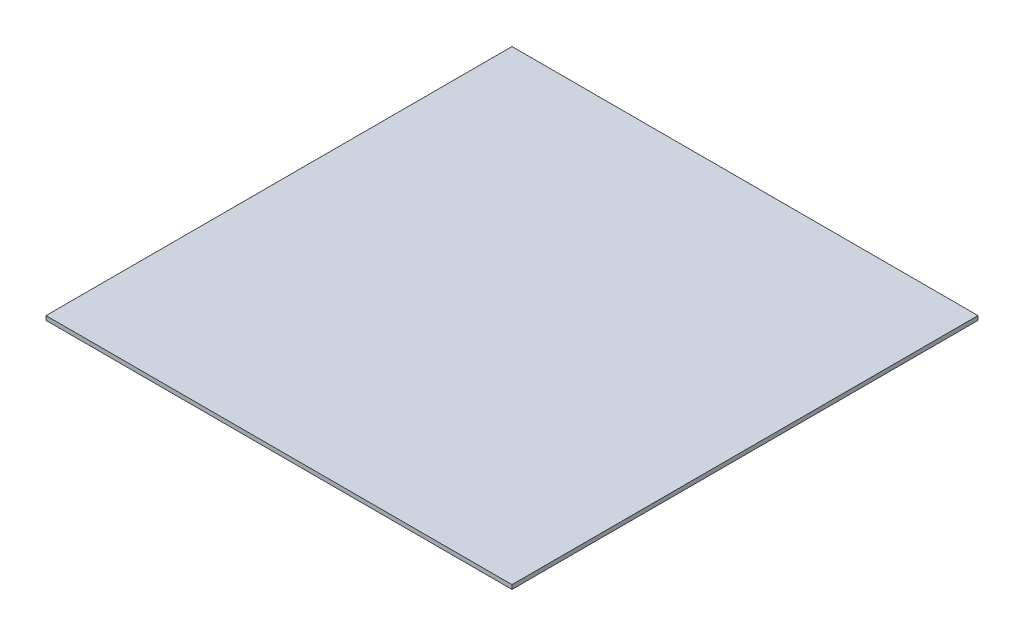
ISO-10303-21;
HEADER;
FILE_DESCRIPTION(('STEP AP214'),'2;1');
FILE_NAME('part.step','',(''),(''),'','','');
FILE_SCHEMA(('AUTOMOTIVE_DESIGN { 1 0 10303 214 1 1 1 1 }'));
ENDSEC;
DATA;
#1=APPLICATION_CONTEXT('core data for automotive mechanical design processes');
#2=APPLICATION_PROTOCOL_DEFINITION('international standard','automotive_design',2000,#1);
#3=PRODUCT_CONTEXT('',#1,'mechanical');
#4=PRODUCT('Part','Part','',(#3));
#5=PRODUCT_RELATED_PRODUCT_CATEGORY('part','',(#4));
#6=PRODUCT_DEFINITION_FORMATION('','',#4);
#7=PRODUCT_DEFINITION_CONTEXT('part definition',#1,'design');
#8=PRODUCT_DEFINITION('design','',#6,#7);
#9=PRODUCT_DEFINITION_SHAPE('','',#8);
#10=(LENGTH_UNIT() NAMED_UNIT(*) SI_UNIT(.MILLI.,.METRE.));
#11=(NAMED_UNIT(*) PLANE_ANGLE_UNIT() SI_UNIT($,.RADIAN.));
#12=(NAMED_UNIT(*) SI_UNIT($,.STERADIAN.) SOLID_ANGLE_UNIT());
#13=UNCERTAINTY_MEASURE_WITH_UNIT(LENGTH_MEASURE(1.E-05),#10,'distance_accuracy_value','');
#14=(GEOMETRIC_REPRESENTATION_CONTEXT(3) GLOBAL_UNCERTAINTY_ASSIGNED_CONTEXT((#13)) GLOBAL_UNIT_ASSIGNED_CONTEXT((#10,
#11,#12)) REPRESENTATION_CONTEXT('',''));
#15=CARTESIAN_POINT('',(0.,0.,0.));
#16=DIRECTION('',(0.,0.,1.));
#17=DIRECTION('',(1.,0.,0.));
#18=AXIS2_PLACEMENT_3D('',#15,#16,#17);
#19=CARTESIAN_POINT('',(250.,4.5,-250.));
#20=DIRECTION('',(-1.,0.,0.));
#21=DIRECTION('',(0.,0.,1.));
#22=AXIS2_PLACEMENT_3D('',#19,#20,#21);
#23=PLANE('',#22);
#24=DIRECTION('',(0.,0.,-1.));
#25=VECTOR('',#24,1.);
#26=CARTESIAN_POINT('',(250.,0.,-250.));
#27=LINE('',#26,#25);
#28=CARTESIAN_POINT('',(250.,0.,250.));
#29=VERTEX_POINT('',#28);
#30=CARTESIAN_POINT('',(250.,0.,-250.));
#31=VERTEX_POINT('',#30);
#32=EDGE_CURVE('E96',#29,#31,#27,.T.);
#33=ORIENTED_EDGE('',*,*,#32,.T.);
#34=DIRECTION('',(0.,-1.,0.));
#35=VECTOR('',#34,1.);
#36=CARTESIAN_POINT('',(250.,4.5,-250.));
#37=LINE('',#36,#35);
#38=CARTESIAN_POINT('',(250.,4.5,-250.));
#39=VERTEX_POINT('',#38);
#40=EDGE_CURVE('E11',#39,#31,#37,.T.);
#41=ORIENTED_EDGE('',*,*,#40,.F.);
#42=DIRECTION('',(0.,0.,-1.));
#43=VECTOR('',#42,1.);
#44=CARTESIAN_POINT('',(250.,4.5,-250.));
#45=LINE('',#44,#43);
#46=CARTESIAN_POINT('',(250.,4.5,250.));
#47=VERTEX_POINT('',#46);
#48=EDGE_CURVE('E84',#47,#39,#45,.T.);
#49=ORIENTED_EDGE('',*,*,#48,.F.);
#50=DIRECTION('',(0.,-1.,0.));
#51=VECTOR('',#50,1.);
#52=CARTESIAN_POINT('',(250.,4.5,250.));
#53=LINE('',#52,#51);
#54=EDGE_CURVE('E92',#47,#29,#53,.T.);
#55=ORIENTED_EDGE('',*,*,#54,.T.);
#56=EDGE_LOOP('',(#33,#41,#49,#55));
#57=FACE_BOUND('',#56,.T.);
#58=ADVANCED_FACE('F33',(#57),#23,.F.);
#59=CARTESIAN_POINT('',(-250.,4.5,-250.));
#60=DIRECTION('',(0.,0.,1.));
#61=DIRECTION('',(1.,0.,0.));
#62=AXIS2_PLACEMENT_3D('',#59,#60,#61);
#63=PLANE('',#62);
#64=DIRECTION('',(-1.,0.,0.));
#65=VECTOR('',#64,1.);
#66=CARTESIAN_POINT('',(-250.,0.,-250.));
#67=LINE('',#66,#65);
#68=CARTESIAN_POINT('',(-250.,0.,-250.));
#69=VERTEX_POINT('',#68);
#70=EDGE_CURVE('E88',#31,#69,#67,.T.);
#71=ORIENTED_EDGE('',*,*,#70,.T.);
#72=DIRECTION('',(0.,-1.,0.));
#73=VECTOR('',#72,1.);
#74=CARTESIAN_POINT('',(-250.,4.5,-250.));
#75=LINE('',#74,#73);
#76=CARTESIAN_POINT('',(-250.,4.5,-250.));
#77=VERTEX_POINT('',#76);
#78=EDGE_CURVE('E41',#77,#69,#75,.T.);
#79=ORIENTED_EDGE('',*,*,#78,.F.);
#80=DIRECTION('',(-1.,0.,0.));
#81=VECTOR('',#80,1.);
#82=CARTESIAN_POINT('',(-250.,4.5,-250.));
#83=LINE('',#82,#81);
#84=EDGE_CURVE('E79',#39,#77,#83,.T.);
#85=ORIENTED_EDGE('',*,*,#84,.F.);
#86=ORIENTED_EDGE('',*,*,#40,.T.);
#87=EDGE_LOOP('',(#71,#79,#85,#86));
#88=FACE_BOUND('',#87,.T.);
#89=ADVANCED_FACE('F87',(#88),#63,.F.);
#90=CARTESIAN_POINT('',(-250.,4.5,-250.));
#91=DIRECTION('',(1.,0.,0.));
#92=DIRECTION('',(0.,0.,-1.));
#93=AXIS2_PLACEMENT_3D('',#90,#91,#92);
#94=PLANE('',#93);
#95=DIRECTION('',(0.,0.,1.));
#96=VECTOR('',#95,1.);
#97=CARTESIAN_POINT('',(-250.,0.,-250.));
#98=LINE('',#97,#96);
#99=CARTESIAN_POINT('',(-250.,0.,250.));
#100=VERTEX_POINT('',#99);
#101=EDGE_CURVE('E66',#69,#100,#98,.T.);
#102=ORIENTED_EDGE('',*,*,#101,.T.);
#103=DIRECTION('',(0.,-1.,0.));
#104=VECTOR('',#103,1.);
#105=CARTESIAN_POINT('',(-250.,4.5,250.));
#106=LINE('',#105,#104);
#107=CARTESIAN_POINT('',(-250.,4.5,250.));
#108=VERTEX_POINT('',#107);
#109=EDGE_CURVE('E89',#108,#100,#106,.T.);
#110=ORIENTED_EDGE('',*,*,#109,.F.);
#111=DIRECTION('',(0.,0.,1.));
#112=VECTOR('',#111,1.);
#113=CARTESIAN_POINT('',(-250.,4.5,-250.));
#114=LINE('',#113,#112);
#115=EDGE_CURVE('E82',#77,#108,#114,.T.);
#116=ORIENTED_EDGE('',*,*,#115,.F.);
#117=ORIENTED_EDGE('',*,*,#78,.T.);
#118=EDGE_LOOP('',(#102,#110,#116,#117));
#119=FACE_BOUND('',#118,.T.);
#120=ADVANCED_FACE('F90',(#119),#94,.F.);
#121=CARTESIAN_POINT('',(-250.,4.5,250.));
#122=DIRECTION('',(0.,0.,-1.));
#123=DIRECTION('',(-1.,0.,0.));
#124=AXIS2_PLACEMENT_3D('',#121,#122,#123);
#125=PLANE('',#124);
#126=DIRECTION('',(1.,0.,0.));
#127=VECTOR('',#126,1.);
#128=CARTESIAN_POINT('',(-250.,0.,250.));
#129=LINE('',#128,#127);
#130=EDGE_CURVE('E72',#100,#29,#129,.T.);
#131=ORIENTED_EDGE('',*,*,#130,.T.);
#132=ORIENTED_EDGE('',*,*,#54,.F.);
#133=DIRECTION('',(1.,0.,0.));
#134=VECTOR('',#133,1.);
#135=CARTESIAN_POINT('',(-250.,4.5,250.));
#136=LINE('',#135,#134);
#137=EDGE_CURVE('E49',#108,#47,#136,.T.);
#138=ORIENTED_EDGE('',*,*,#137,.F.);
#139=ORIENTED_EDGE('',*,*,#109,.T.);
#140=EDGE_LOOP('',(#131,#132,#138,#139));
#141=FACE_BOUND('',#140,.T.);
#142=ADVANCED_FACE('F103',(#141),#125,.F.);
#143=CARTESIAN_POINT('',(0.,4.5,0.));
#144=DIRECTION('',(0.,1.,0.));
#145=DIRECTION('',(0.,0.,1.));
#146=AXIS2_PLACEMENT_3D('',#143,#144,#145);
#147=PLANE('',#146);
#148=ORIENTED_EDGE('',*,*,#48,.T.);
#149=ORIENTED_EDGE('',*,*,#84,.T.);
#150=ORIENTED_EDGE('',*,*,#115,.T.);
#151=ORIENTED_EDGE('',*,*,#137,.T.);
#152=EDGE_LOOP('',(#148,#149,#150,#151));
#153=FACE_BOUND('',#152,.T.);
#154=ADVANCED_FACE('F80',(#153),#147,.T.);
#155=CARTESIAN_POINT('',(0.,0.,0.));
#156=DIRECTION('',(0.,1.,0.));
#157=DIRECTION('',(0.,0.,1.));
#158=AXIS2_PLACEMENT_3D('',#155,#156,#157);
#159=PLANE('',#158);
#160=ORIENTED_EDGE('',*,*,#32,.F.);
#161=ORIENTED_EDGE('',*,*,#130,.F.);
#162=ORIENTED_EDGE('',*,*,#101,.F.);
#163=ORIENTED_EDGE('',*,*,#70,.F.);
#164=EDGE_LOOP('',(#160,#161,#162,#163));
#165=FACE_BOUND('',#164,.T.);
#166=ADVANCED_FACE('F106',(#165),#159,.F.);
#167=CLOSED_SHELL('',(#58,#89,#120,#142,#154,#166));
#168=MANIFOLD_SOLID_BREP('B2',#167);
#169=ADVANCED_BREP_SHAPE_REPRESENTATION('',(#18,#168),#14);
#170=SHAPE_DEFINITION_REPRESENTATION(#9,#169);
ENDSEC;
END-ISO-10303-21;
